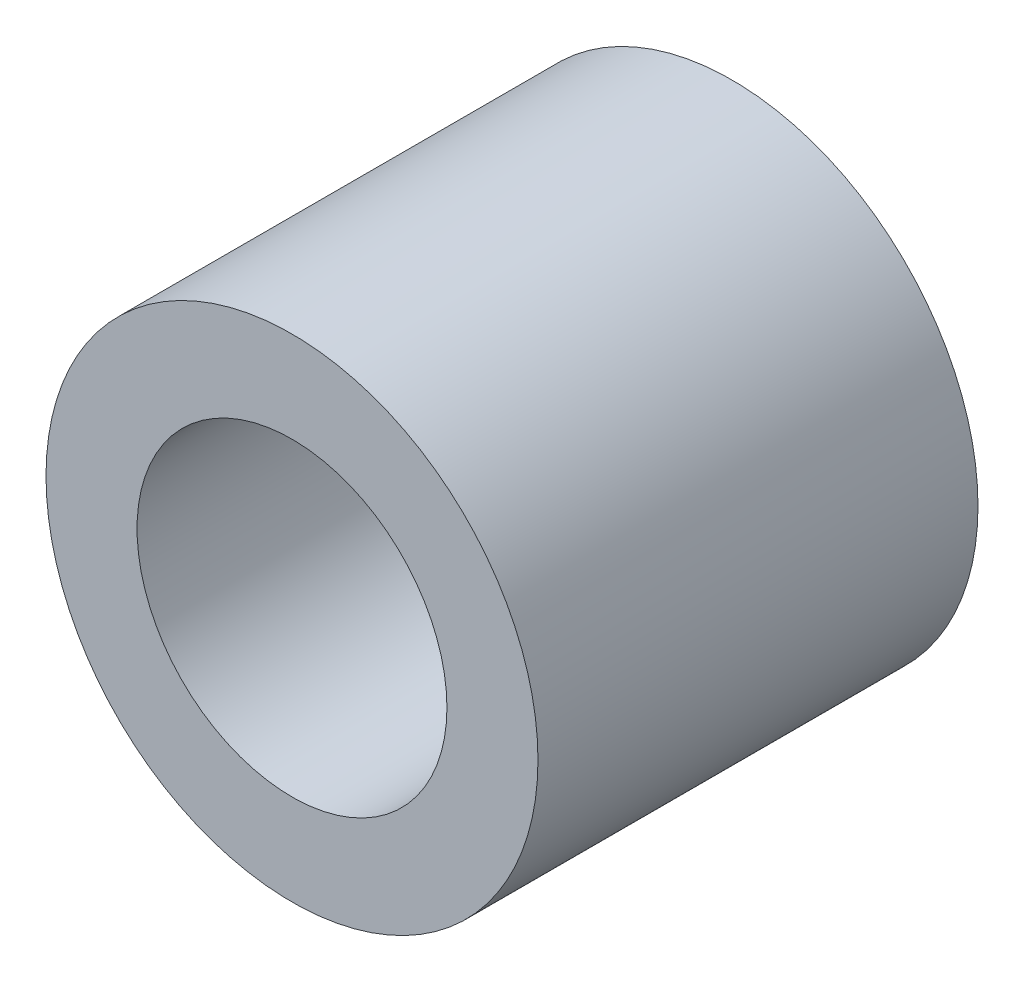
ISO-10303-21;
HEADER;
FILE_DESCRIPTION(('STEP AP214'),'2;1');
FILE_NAME('part.step','',(''),(''),'','','');
FILE_SCHEMA(('AUTOMOTIVE_DESIGN { 1 0 10303 214 1 1 1 1 }'));
ENDSEC;
DATA;
#1=APPLICATION_CONTEXT('core data for automotive mechanical design processes');
#2=APPLICATION_PROTOCOL_DEFINITION('international standard','automotive_design',2000,#1);
#3=PRODUCT_CONTEXT('',#1,'mechanical');
#4=PRODUCT('Part','Part','',(#3));
#5=PRODUCT_RELATED_PRODUCT_CATEGORY('part','',(#4));
#6=PRODUCT_DEFINITION_FORMATION('','',#4);
#7=PRODUCT_DEFINITION_CONTEXT('part definition',#1,'design');
#8=PRODUCT_DEFINITION('design','',#6,#7);
#9=PRODUCT_DEFINITION_SHAPE('','',#8);
#10=(LENGTH_UNIT() NAMED_UNIT(*) SI_UNIT(.MILLI.,.METRE.));
#11=(NAMED_UNIT(*) PLANE_ANGLE_UNIT() SI_UNIT($,.RADIAN.));
#12=(NAMED_UNIT(*) SI_UNIT($,.STERADIAN.) SOLID_ANGLE_UNIT());
#13=UNCERTAINTY_MEASURE_WITH_UNIT(LENGTH_MEASURE(1.E-05),#10,'distance_accuracy_value','');
#14=(GEOMETRIC_REPRESENTATION_CONTEXT(3) GLOBAL_UNCERTAINTY_ASSIGNED_CONTEXT((#13)) GLOBAL_UNIT_ASSIGNED_CONTEXT((#10,
#11,#12)) REPRESENTATION_CONTEXT('',''));
#15=CARTESIAN_POINT('',(0.,0.,0.));
#16=DIRECTION('',(0.,0.,1.));
#17=DIRECTION('',(1.,0.,0.));
#18=AXIS2_PLACEMENT_3D('',#15,#16,#17);
#19=CARTESIAN_POINT('',(0.,0.,2.271749965));
#20=DIRECTION('',(0.,0.,1.));
#21=DIRECTION('',(1.,0.,0.));
#22=AXIS2_PLACEMENT_3D('',#19,#20,#21);
#23=PLANE('',#22);
#24=CARTESIAN_POINT('',(0.,0.,2.271749965));
#25=DIRECTION('',(0.,0.,1.));
#26=DIRECTION('',(1.,0.,0.));
#27=AXIS2_PLACEMENT_3D('',#24,#25,#26);
#28=CIRCLE('',#27,2.54);
#29=CARTESIAN_POINT('',(2.54,0.,2.271749965));
#30=VERTEX_POINT('',#29);
#31=EDGE_CURVE('E10',#30,#30,#28,.T.);
#32=ORIENTED_EDGE('',*,*,#31,.T.);
#33=EDGE_LOOP('',(#32));
#34=FACE_BOUND('',#33,.T.);
#35=CARTESIAN_POINT('',(0.,0.,2.271749965));
#36=DIRECTION('',(0.,0.,1.));
#37=DIRECTION('',(1.,0.,0.));
#38=AXIS2_PLACEMENT_3D('',#35,#36,#37);
#39=CIRCLE('',#38,1.6);
#40=CARTESIAN_POINT('',(1.6,0.,2.271749965));
#41=VERTEX_POINT('',#40);
#42=EDGE_CURVE('E42',#41,#41,#39,.T.);
#43=ORIENTED_EDGE('',*,*,#42,.F.);
#44=EDGE_LOOP('',(#43));
#45=FACE_BOUND('',#44,.T.);
#46=ADVANCED_FACE('F31',(#34,#45),#23,.T.);
#47=CARTESIAN_POINT('',(0.,0.,-2.271749965));
#48=DIRECTION('',(0.,0.,1.));
#49=DIRECTION('',(1.,0.,0.));
#50=AXIS2_PLACEMENT_3D('',#47,#48,#49);
#51=PLANE('',#50);
#52=CARTESIAN_POINT('',(0.,0.,-2.271749965));
#53=DIRECTION('',(0.,0.,1.));
#54=DIRECTION('',(1.,0.,0.));
#55=AXIS2_PLACEMENT_3D('',#52,#53,#54);
#56=CIRCLE('',#55,2.54);
#57=CARTESIAN_POINT('',(2.54,0.,-2.271749965));
#58=VERTEX_POINT('',#57);
#59=EDGE_CURVE('E35',#58,#58,#56,.T.);
#60=ORIENTED_EDGE('',*,*,#59,.F.);
#61=EDGE_LOOP('',(#60));
#62=FACE_BOUND('',#61,.T.);
#63=CARTESIAN_POINT('',(0.,0.,-2.271749965));
#64=DIRECTION('',(0.,0.,1.));
#65=DIRECTION('',(1.,0.,0.));
#66=AXIS2_PLACEMENT_3D('',#63,#64,#65);
#67=CIRCLE('',#66,1.6);
#68=CARTESIAN_POINT('',(1.6,0.,-2.271749965));
#69=VERTEX_POINT('',#68);
#70=EDGE_CURVE('E44',#69,#69,#67,.T.);
#71=ORIENTED_EDGE('',*,*,#70,.T.);
#72=EDGE_LOOP('',(#71));
#73=FACE_BOUND('',#72,.T.);
#74=ADVANCED_FACE('F54',(#62,#73),#51,.F.);
#75=CARTESIAN_POINT('',(0.,0.,2.271749965));
#76=DIRECTION('',(0.,0.,-1.));
#77=DIRECTION('',(-1.,0.,0.));
#78=AXIS2_PLACEMENT_3D('',#75,#76,#77);
#79=CYLINDRICAL_SURFACE('',#78,2.54);
#80=ORIENTED_EDGE('',*,*,#31,.F.);
#81=EDGE_LOOP('',(#80));
#82=FACE_BOUND('',#81,.T.);
#83=ORIENTED_EDGE('',*,*,#59,.T.);
#84=EDGE_LOOP('',(#83));
#85=FACE_BOUND('',#84,.T.);
#86=ADVANCED_FACE('F33',(#82,#85),#79,.T.);
#87=CARTESIAN_POINT('',(0.,0.,2.271749965));
#88=DIRECTION('',(0.,0.,-1.));
#89=DIRECTION('',(-1.,0.,0.));
#90=AXIS2_PLACEMENT_3D('',#87,#88,#89);
#91=CYLINDRICAL_SURFACE('',#90,1.6);
#92=ORIENTED_EDGE('',*,*,#42,.T.);
#93=EDGE_LOOP('',(#92));
#94=FACE_BOUND('',#93,.T.);
#95=ORIENTED_EDGE('',*,*,#70,.F.);
#96=EDGE_LOOP('',(#95));
#97=FACE_BOUND('',#96,.T.);
#98=ADVANCED_FACE('F50',(#94,#97),#91,.F.);
#99=CLOSED_SHELL('',(#46,#74,#86,#98));
#100=MANIFOLD_SOLID_BREP('B2',#99);
#101=ADVANCED_BREP_SHAPE_REPRESENTATION('',(#18,#100),#14);
#102=SHAPE_DEFINITION_REPRESENTATION(#9,#101);
ENDSEC;
END-ISO-10303-21;
